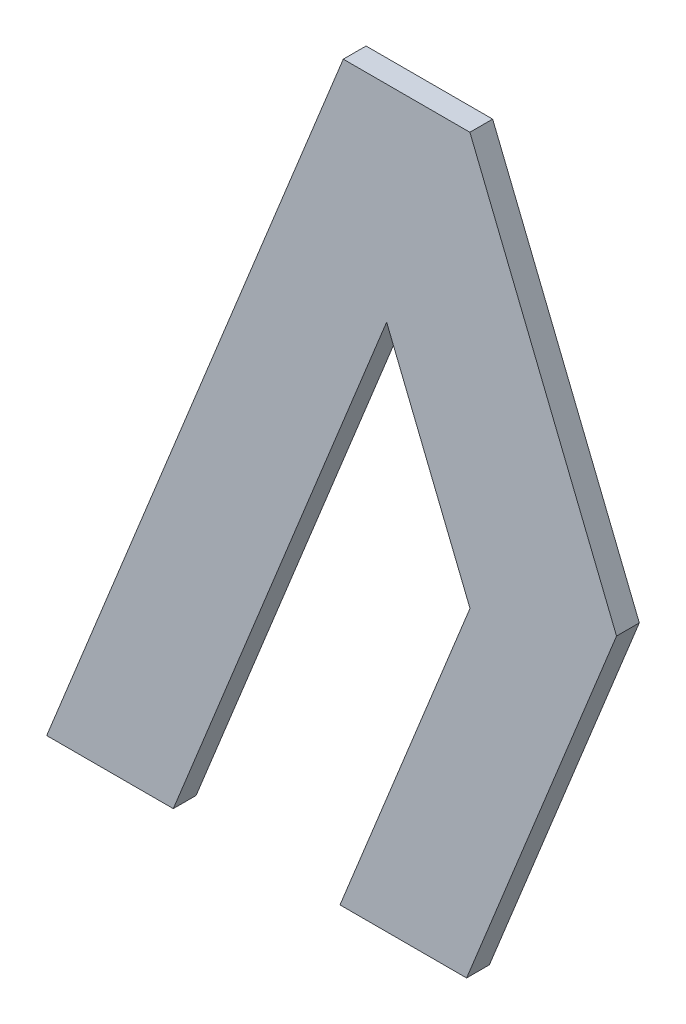
ISO-10303-21;
HEADER;
FILE_DESCRIPTION(('STEP AP214'),'2;1');
FILE_NAME('part.step','',(''),(''),'','','');
FILE_SCHEMA(('AUTOMOTIVE_DESIGN { 1 0 10303 214 1 1 1 1 }'));
ENDSEC;
DATA;
#1=APPLICATION_CONTEXT('core data for automotive mechanical design processes');
#2=APPLICATION_PROTOCOL_DEFINITION('international standard','automotive_design',2000,#1);
#3=PRODUCT_CONTEXT('',#1,'mechanical');
#4=PRODUCT('Part','Part','',(#3));
#5=PRODUCT_RELATED_PRODUCT_CATEGORY('part','',(#4));
#6=PRODUCT_DEFINITION_FORMATION('','',#4);
#7=PRODUCT_DEFINITION_CONTEXT('part definition',#1,'design');
#8=PRODUCT_DEFINITION('design','',#6,#7);
#9=PRODUCT_DEFINITION_SHAPE('','',#8);
#10=(LENGTH_UNIT() NAMED_UNIT(*) SI_UNIT(.MILLI.,.METRE.));
#11=(NAMED_UNIT(*) PLANE_ANGLE_UNIT() SI_UNIT($,.RADIAN.));
#12=(NAMED_UNIT(*) SI_UNIT($,.STERADIAN.) SOLID_ANGLE_UNIT());
#13=UNCERTAINTY_MEASURE_WITH_UNIT(LENGTH_MEASURE(1.E-05),#10,'distance_accuracy_value','');
#14=(GEOMETRIC_REPRESENTATION_CONTEXT(3) GLOBAL_UNCERTAINTY_ASSIGNED_CONTEXT((#13)) GLOBAL_UNIT_ASSIGNED_CONTEXT((#10,
#11,#12)) REPRESENTATION_CONTEXT('',''));
#15=CARTESIAN_POINT('',(0.,0.,0.));
#16=DIRECTION('',(0.,0.,1.));
#17=DIRECTION('',(1.,0.,0.));
#18=AXIS2_PLACEMENT_3D('',#15,#16,#17);
#19=CARTESIAN_POINT('',(0.141532417951036,-0.56437912510646,0.));
#20=DIRECTION('',(0.,-1.,0.));
#21=DIRECTION('',(1.,0.,0.));
#22=AXIS2_PLACEMENT_3D('',#19,#20,#21);
#23=PLANE('',#22);
#24=DIRECTION('',(1.,0.,0.));
#25=VECTOR('',#24,1.);
#26=CARTESIAN_POINT('',(0.141532417951036,-0.56437912510646,0.));
#27=LINE('',#26,#25);
#28=CARTESIAN_POINT('',(0.141532417951036,-0.56437912510646,0.));
#29=VERTEX_POINT('',#28);
#30=CARTESIAN_POINT('',(0.158209417951036,-0.56437912510646,0.));
#31=VERTEX_POINT('',#30);
#32=EDGE_CURVE('E11',#29,#31,#27,.T.);
#33=ORIENTED_EDGE('',*,*,#32,.T.);
#34=DIRECTION('',(0.,0.,1.));
#35=VECTOR('',#34,1.);
#36=CARTESIAN_POINT('',(0.158209417951036,-0.56437912510646,0.));
#37=LINE('',#36,#35);
#38=CARTESIAN_POINT('',(0.158209417951036,-0.56437912510646,0.003));
#39=VERTEX_POINT('',#38);
#40=EDGE_CURVE('E24',#31,#39,#37,.T.);
#41=ORIENTED_EDGE('',*,*,#40,.T.);
#42=DIRECTION('',(1.,0.,0.));
#43=VECTOR('',#42,1.);
#44=CARTESIAN_POINT('',(0.141532417951036,-0.56437912510646,0.003));
#45=LINE('',#44,#43);
#46=CARTESIAN_POINT('',(0.141532417951036,-0.56437912510646,0.003));
#47=VERTEX_POINT('',#46);
#48=EDGE_CURVE('E106',#47,#39,#45,.T.);
#49=ORIENTED_EDGE('',*,*,#48,.F.);
#50=DIRECTION('',(0.,0.,1.));
#51=VECTOR('',#50,1.);
#52=CARTESIAN_POINT('',(0.141532417951036,-0.56437912510646,0.));
#53=LINE('',#52,#51);
#54=EDGE_CURVE('E161',#29,#47,#53,.T.);
#55=ORIENTED_EDGE('',*,*,#54,.F.);
#56=EDGE_LOOP('',(#33,#41,#49,#55));
#57=FACE_BOUND('',#56,.T.);
#58=ADVANCED_FACE('F17',(#57),#23,.T.);
#59=CARTESIAN_POINT('',(0.158656572484486,-0.521995355344909,0.));
#60=DIRECTION('',(-0.9271838545666,0.374606593416375,0.));
#61=DIRECTION('',(-0.374606593416375,-0.9271838545666,0.));
#62=AXIS2_PLACEMENT_3D('',#59,#60,#61);
#63=PLANE('',#62);
#64=DIRECTION('',(-0.374606593416375,-0.9271838545666,0.));
#65=VECTOR('',#64,1.);
#66=CARTESIAN_POINT('',(0.158656572484486,-0.521995355344909,0.));
#67=LINE('',#66,#65);
#68=CARTESIAN_POINT('',(0.158656572484486,-0.521995355344909,0.));
#69=VERTEX_POINT('',#68);
#70=EDGE_CURVE('E158',#69,#29,#67,.T.);
#71=ORIENTED_EDGE('',*,*,#70,.T.);
#72=ORIENTED_EDGE('',*,*,#54,.T.);
#73=DIRECTION('',(-0.374606593416375,-0.9271838545666,0.));
#74=VECTOR('',#73,1.);
#75=CARTESIAN_POINT('',(0.158656572484486,-0.521995355344909,0.003));
#76=LINE('',#75,#74);
#77=CARTESIAN_POINT('',(0.158656572484486,-0.521995355344909,0.003));
#78=VERTEX_POINT('',#77);
#79=EDGE_CURVE('E156',#78,#47,#76,.T.);
#80=ORIENTED_EDGE('',*,*,#79,.F.);
#81=DIRECTION('',(0.,0.,1.));
#82=VECTOR('',#81,1.);
#83=CARTESIAN_POINT('',(0.158656572484486,-0.521995355344909,0.));
#84=LINE('',#83,#82);
#85=EDGE_CURVE('E153',#69,#78,#84,.T.);
#86=ORIENTED_EDGE('',*,*,#85,.F.);
#87=EDGE_LOOP('',(#71,#72,#80,#86));
#88=FACE_BOUND('',#87,.T.);
#89=ADVANCED_FACE('F181',(#88),#63,.T.);
#90=CARTESIAN_POINT('',(0.147677568561766,-0.494821367072109,0.));
#91=DIRECTION('',(-0.927183854567122,-0.374606593415085,0.));
#92=DIRECTION('',(0.374606593415085,-0.927183854567122,0.));
#93=AXIS2_PLACEMENT_3D('',#90,#91,#92);
#94=PLANE('',#93);
#95=DIRECTION('',(0.374606593415085,-0.927183854567122,0.));
#96=VECTOR('',#95,1.);
#97=CARTESIAN_POINT('',(0.147677568561766,-0.494821367072109,0.));
#98=LINE('',#97,#96);
#99=CARTESIAN_POINT('',(0.147677568561766,-0.494821367072109,0.));
#100=VERTEX_POINT('',#99);
#101=EDGE_CURVE('E150',#100,#69,#98,.T.);
#102=ORIENTED_EDGE('',*,*,#101,.T.);
#103=ORIENTED_EDGE('',*,*,#85,.T.);
#104=DIRECTION('',(0.374606593415085,-0.927183854567122,0.));
#105=VECTOR('',#104,1.);
#106=CARTESIAN_POINT('',(0.147677568561766,-0.494821367072109,0.003));
#107=LINE('',#106,#105);
#108=CARTESIAN_POINT('',(0.147677568561766,-0.494821367072109,0.003));
#109=VERTEX_POINT('',#108);
#110=EDGE_CURVE('E147',#109,#78,#107,.T.);
#111=ORIENTED_EDGE('',*,*,#110,.F.);
#112=DIRECTION('',(0.,0.,1.));
#113=VECTOR('',#112,1.);
#114=CARTESIAN_POINT('',(0.147677568561766,-0.494821367072109,0.));
#115=LINE('',#114,#113);
#116=EDGE_CURVE('E144',#100,#109,#115,.T.);
#117=ORIENTED_EDGE('',*,*,#116,.F.);
#118=EDGE_LOOP('',(#102,#103,#111,#117));
#119=FACE_BOUND('',#118,.T.);
#120=ADVANCED_FACE('F178',(#119),#94,.T.);
#121=CARTESIAN_POINT('',(0.119574410105596,-0.56437912510646,0.));
#122=DIRECTION('',(0.927183854566804,-0.374606593415871,0.));
#123=DIRECTION('',(0.374606593415871,0.927183854566804,0.));
#124=AXIS2_PLACEMENT_3D('',#121,#122,#123);
#125=PLANE('',#124);
#126=DIRECTION('',(0.374606593415871,0.927183854566804,0.));
#127=VECTOR('',#126,1.);
#128=CARTESIAN_POINT('',(0.119574410105596,-0.56437912510646,0.));
#129=LINE('',#128,#127);
#130=CARTESIAN_POINT('',(0.119574410105596,-0.56437912510646,0.));
#131=VERTEX_POINT('',#130);
#132=EDGE_CURVE('E141',#131,#100,#129,.T.);
#133=ORIENTED_EDGE('',*,*,#132,.T.);
#134=ORIENTED_EDGE('',*,*,#116,.T.);
#135=DIRECTION('',(0.374606593415871,0.927183854566804,0.));
#136=VECTOR('',#135,1.);
#137=CARTESIAN_POINT('',(0.119574410105596,-0.56437912510646,0.003));
#138=LINE('',#137,#136);
#139=CARTESIAN_POINT('',(0.119574410105596,-0.56437912510646,0.003));
#140=VERTEX_POINT('',#139);
#141=EDGE_CURVE('E138',#140,#109,#138,.T.);
#142=ORIENTED_EDGE('',*,*,#141,.F.);
#143=DIRECTION('',(0.,0.,1.));
#144=VECTOR('',#143,1.);
#145=CARTESIAN_POINT('',(0.119574410105596,-0.56437912510646,0.));
#146=LINE('',#145,#144);
#147=EDGE_CURVE('E135',#131,#140,#146,.T.);
#148=ORIENTED_EDGE('',*,*,#147,.F.);
#149=EDGE_LOOP('',(#133,#134,#142,#148));
#150=FACE_BOUND('',#149,.T.);
#151=ADVANCED_FACE('F175',(#150),#125,.T.);
#152=CARTESIAN_POINT('',(0.102897410105567,-0.56437912510646,0.));
#153=DIRECTION('',(0.,-1.,0.));
#154=DIRECTION('',(1.,0.,0.));
#155=AXIS2_PLACEMENT_3D('',#152,#153,#154);
#156=PLANE('',#155);
#157=DIRECTION('',(1.,0.,0.));
#158=VECTOR('',#157,1.);
#159=CARTESIAN_POINT('',(0.102897410105567,-0.56437912510646,0.));
#160=LINE('',#159,#158);
#161=CARTESIAN_POINT('',(0.102897410105567,-0.56437912510646,0.));
#162=VERTEX_POINT('',#161);
#163=EDGE_CURVE('E132',#162,#131,#160,.T.);
#164=ORIENTED_EDGE('',*,*,#163,.T.);
#165=ORIENTED_EDGE('',*,*,#147,.T.);
#166=DIRECTION('',(1.,0.,0.));
#167=VECTOR('',#166,1.);
#168=CARTESIAN_POINT('',(0.102897410105567,-0.56437912510646,0.003));
#169=LINE('',#168,#167);
#170=CARTESIAN_POINT('',(0.102897410105567,-0.56437912510646,0.003));
#171=VERTEX_POINT('',#170);
#172=EDGE_CURVE('E129',#171,#140,#169,.T.);
#173=ORIENTED_EDGE('',*,*,#172,.F.);
#174=DIRECTION('',(0.,0.,1.));
#175=VECTOR('',#174,1.);
#176=CARTESIAN_POINT('',(0.102897410105567,-0.56437912510646,0.));
#177=LINE('',#176,#175);
#178=EDGE_CURVE('E126',#162,#171,#177,.T.);
#179=ORIENTED_EDGE('',*,*,#178,.F.);
#180=EDGE_LOOP('',(#164,#165,#173,#179));
#181=FACE_BOUND('',#180,.T.);
#182=ADVANCED_FACE('F172',(#181),#156,.T.);
#183=CARTESIAN_POINT('',(0.141965130038861,-0.467683125106459,0.));
#184=DIRECTION('',(-0.927183854566996,0.374606593415396,0.));
#185=DIRECTION('',(-0.374606593415396,-0.927183854566996,0.));
#186=AXIS2_PLACEMENT_3D('',#183,#184,#185);
#187=PLANE('',#186);
#188=DIRECTION('',(-0.374606593415396,-0.927183854566996,0.));
#189=VECTOR('',#188,1.);
#190=CARTESIAN_POINT('',(0.141965130038861,-0.467683125106459,0.));
#191=LINE('',#190,#189);
#192=CARTESIAN_POINT('',(0.141965130038861,-0.467683125106459,0.));
#193=VERTEX_POINT('',#192);
#194=EDGE_CURVE('E123',#193,#162,#191,.T.);
#195=ORIENTED_EDGE('',*,*,#194,.T.);
#196=ORIENTED_EDGE('',*,*,#178,.T.);
#197=DIRECTION('',(-0.374606593415396,-0.927183854566996,0.));
#198=VECTOR('',#197,1.);
#199=CARTESIAN_POINT('',(0.141965130038861,-0.467683125106459,0.003));
#200=LINE('',#199,#198);
#201=CARTESIAN_POINT('',(0.141965130038861,-0.467683125106459,0.003));
#202=VERTEX_POINT('',#201);
#203=EDGE_CURVE('E120',#202,#171,#200,.T.);
#204=ORIENTED_EDGE('',*,*,#203,.F.);
#205=DIRECTION('',(0.,0.,1.));
#206=VECTOR('',#205,1.);
#207=CARTESIAN_POINT('',(0.141965130038861,-0.467683125106459,0.));
#208=LINE('',#207,#206);
#209=EDGE_CURVE('E117',#193,#202,#208,.T.);
#210=ORIENTED_EDGE('',*,*,#209,.F.);
#211=EDGE_LOOP('',(#195,#196,#204,#210));
#212=FACE_BOUND('',#211,.T.);
#213=ADVANCED_FACE('F169',(#212),#187,.T.);
#214=CARTESIAN_POINT('',(0.158642130038861,-0.467683125106459,0.));
#215=DIRECTION('',(0.,1.,0.));
#216=DIRECTION('',(-1.,0.,0.));
#217=AXIS2_PLACEMENT_3D('',#214,#215,#216);
#218=PLANE('',#217);
#219=DIRECTION('',(-1.,0.,0.));
#220=VECTOR('',#219,1.);
#221=CARTESIAN_POINT('',(0.158642130038861,-0.467683125106459,0.));
#222=LINE('',#221,#220);
#223=CARTESIAN_POINT('',(0.158642130038861,-0.467683125106459,0.));
#224=VERTEX_POINT('',#223);
#225=EDGE_CURVE('E114',#224,#193,#222,.T.);
#226=ORIENTED_EDGE('',*,*,#225,.T.);
#227=ORIENTED_EDGE('',*,*,#209,.T.);
#228=DIRECTION('',(-1.,0.,0.));
#229=VECTOR('',#228,1.);
#230=CARTESIAN_POINT('',(0.158642130038861,-0.467683125106459,0.003));
#231=LINE('',#230,#229);
#232=CARTESIAN_POINT('',(0.158642130038861,-0.467683125106459,0.003));
#233=VERTEX_POINT('',#232);
#234=EDGE_CURVE('E112',#233,#202,#231,.T.);
#235=ORIENTED_EDGE('',*,*,#234,.F.);
#236=DIRECTION('',(0.,0.,1.));
#237=VECTOR('',#236,1.);
#238=CARTESIAN_POINT('',(0.158642130038861,-0.467683125106459,0.));
#239=LINE('',#238,#237);
#240=EDGE_CURVE('E91',#224,#233,#239,.T.);
#241=ORIENTED_EDGE('',*,*,#240,.F.);
#242=EDGE_LOOP('',(#226,#227,#235,#241));
#243=FACE_BOUND('',#242,.T.);
#244=ADVANCED_FACE('F167',(#243),#218,.T.);
#245=CARTESIAN_POINT('',(0.177959633961666,-0.515495625106459,0.));
#246=DIRECTION('',(0.927183854566374,0.374606593416936,0.));
#247=DIRECTION('',(-0.374606593416936,0.927183854566374,0.));
#248=AXIS2_PLACEMENT_3D('',#245,#246,#247);
#249=PLANE('',#248);
#250=DIRECTION('',(-0.374606593416936,0.927183854566374,0.));
#251=VECTOR('',#250,1.);
#252=CARTESIAN_POINT('',(0.177959633961666,-0.515495625106459,0.));
#253=LINE('',#252,#251);
#254=CARTESIAN_POINT('',(0.177959633961666,-0.515495625106459,0.));
#255=VERTEX_POINT('',#254);
#256=EDGE_CURVE('E95',#255,#224,#253,.T.);
#257=ORIENTED_EDGE('',*,*,#256,.T.);
#258=ORIENTED_EDGE('',*,*,#240,.T.);
#259=DIRECTION('',(-0.374606593416936,0.927183854566374,0.));
#260=VECTOR('',#259,1.);
#261=CARTESIAN_POINT('',(0.177959633961666,-0.515495625106459,0.003));
#262=LINE('',#261,#260);
#263=CARTESIAN_POINT('',(0.177959633961666,-0.515495625106459,0.003));
#264=VERTEX_POINT('',#263);
#265=EDGE_CURVE('E84',#264,#233,#262,.T.);
#266=ORIENTED_EDGE('',*,*,#265,.F.);
#267=DIRECTION('',(0.,0.,1.));
#268=VECTOR('',#267,1.);
#269=CARTESIAN_POINT('',(0.177959633961666,-0.515495625106459,0.));
#270=LINE('',#269,#268);
#271=EDGE_CURVE('E88',#255,#264,#270,.T.);
#272=ORIENTED_EDGE('',*,*,#271,.F.);
#273=EDGE_LOOP('',(#257,#258,#266,#272));
#274=FACE_BOUND('',#273,.T.);
#275=ADVANCED_FACE('F87',(#274),#249,.T.);
#276=CARTESIAN_POINT('',(0.158209417951036,-0.56437912510646,0.));
#277=DIRECTION('',(0.927183854566676,-0.374606593416189,0.));
#278=DIRECTION('',(0.374606593416189,0.927183854566676,0.));
#279=AXIS2_PLACEMENT_3D('',#276,#277,#278);
#280=PLANE('',#279);
#281=DIRECTION('',(0.374606593416189,0.927183854566676,0.));
#282=VECTOR('',#281,1.);
#283=CARTESIAN_POINT('',(0.158209417951036,-0.56437912510646,0.));
#284=LINE('',#283,#282);
#285=EDGE_CURVE('E101',#31,#255,#284,.T.);
#286=ORIENTED_EDGE('',*,*,#285,.T.);
#287=ORIENTED_EDGE('',*,*,#271,.T.);
#288=DIRECTION('',(0.374606593416189,0.927183854566676,0.));
#289=VECTOR('',#288,1.);
#290=CARTESIAN_POINT('',(0.158209417951036,-0.56437912510646,0.003));
#291=LINE('',#290,#289);
#292=EDGE_CURVE('E100',#39,#264,#291,.T.);
#293=ORIENTED_EDGE('',*,*,#292,.F.);
#294=ORIENTED_EDGE('',*,*,#40,.F.);
#295=EDGE_LOOP('',(#286,#287,#293,#294));
#296=FACE_BOUND('',#295,.T.);
#297=ADVANCED_FACE('F99',(#296),#280,.T.);
#298=CARTESIAN_POINT('',(0.140428522033617,-0.51603112510646,0.003));
#299=DIRECTION('',(0.,0.,1.));
#300=DIRECTION('',(1.,0.,0.));
#301=AXIS2_PLACEMENT_3D('',#298,#299,#300);
#302=PLANE('',#301);
#303=ORIENTED_EDGE('',*,*,#292,.T.);
#304=ORIENTED_EDGE('',*,*,#265,.T.);
#305=ORIENTED_EDGE('',*,*,#234,.T.);
#306=ORIENTED_EDGE('',*,*,#203,.T.);
#307=ORIENTED_EDGE('',*,*,#172,.T.);
#308=ORIENTED_EDGE('',*,*,#141,.T.);
#309=ORIENTED_EDGE('',*,*,#110,.T.);
#310=ORIENTED_EDGE('',*,*,#79,.T.);
#311=ORIENTED_EDGE('',*,*,#48,.T.);
#312=EDGE_LOOP('',(#303,#304,#305,#306,#307,#308,#309,#310,#311));
#313=FACE_BOUND('',#312,.T.);
#314=ADVANCED_FACE('F104',(#313),#302,.T.);
#315=CARTESIAN_POINT('',(0.140428522033617,-0.51603112510646,0.));
#316=DIRECTION('',(0.,0.,1.));
#317=DIRECTION('',(1.,0.,0.));
#318=AXIS2_PLACEMENT_3D('',#315,#316,#317);
#319=PLANE('',#318);
#320=ORIENTED_EDGE('',*,*,#285,.F.);
#321=ORIENTED_EDGE('',*,*,#32,.F.);
#322=ORIENTED_EDGE('',*,*,#70,.F.);
#323=ORIENTED_EDGE('',*,*,#101,.F.);
#324=ORIENTED_EDGE('',*,*,#132,.F.);
#325=ORIENTED_EDGE('',*,*,#163,.F.);
#326=ORIENTED_EDGE('',*,*,#194,.F.);
#327=ORIENTED_EDGE('',*,*,#225,.F.);
#328=ORIENTED_EDGE('',*,*,#256,.F.);
#329=EDGE_LOOP('',(#320,#321,#322,#323,#324,#325,#326,#327,#328));
#330=FACE_BOUND('',#329,.T.);
#331=ADVANCED_FACE('F164',(#330),#319,.F.);
#332=CLOSED_SHELL('',(#58,#89,#120,#151,#182,#213,#244,#275,#297,#314,#331));
#333=MANIFOLD_SOLID_BREP('B1',#332);
#334=ADVANCED_BREP_SHAPE_REPRESENTATION('',(#18,#333),#14);
#335=SHAPE_DEFINITION_REPRESENTATION(#9,#334);
ENDSEC;
END-ISO-10303-21;
